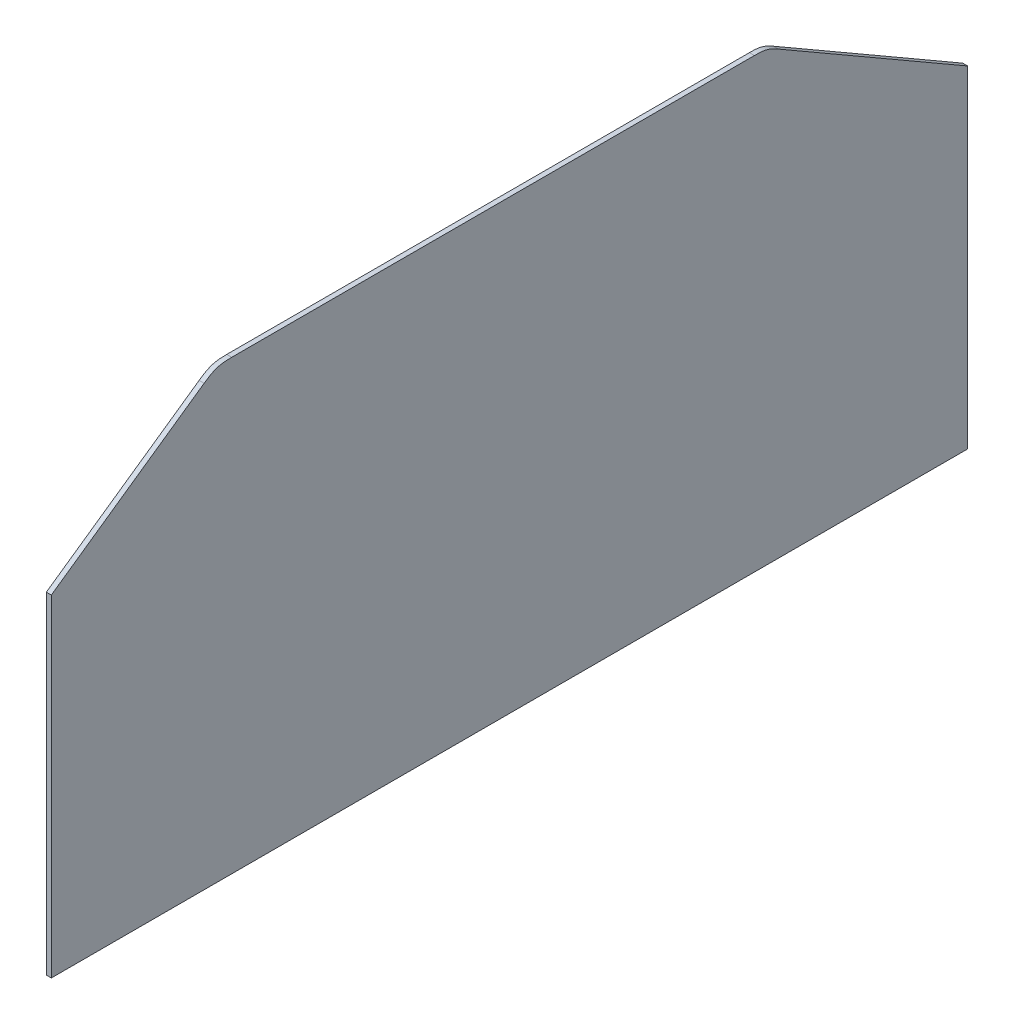
ISO-10303-21;
HEADER;
FILE_DESCRIPTION(('STEP AP214'),'2;1');
FILE_NAME('part.step','',(''),(''),'','','');
FILE_SCHEMA(('AUTOMOTIVE_DESIGN { 1 0 10303 214 1 1 1 1 }'));
ENDSEC;
DATA;
#1=APPLICATION_CONTEXT('core data for automotive mechanical design processes');
#2=APPLICATION_PROTOCOL_DEFINITION('international standard','automotive_design',2000,#1);
#3=PRODUCT_CONTEXT('',#1,'mechanical');
#4=PRODUCT('Part','Part','',(#3));
#5=PRODUCT_RELATED_PRODUCT_CATEGORY('part','',(#4));
#6=PRODUCT_DEFINITION_FORMATION('','',#4);
#7=PRODUCT_DEFINITION_CONTEXT('part definition',#1,'design');
#8=PRODUCT_DEFINITION('design','',#6,#7);
#9=PRODUCT_DEFINITION_SHAPE('','',#8);
#10=(LENGTH_UNIT() NAMED_UNIT(*) SI_UNIT(.MILLI.,.METRE.));
#11=(NAMED_UNIT(*) PLANE_ANGLE_UNIT() SI_UNIT($,.RADIAN.));
#12=(NAMED_UNIT(*) SI_UNIT($,.STERADIAN.) SOLID_ANGLE_UNIT());
#13=UNCERTAINTY_MEASURE_WITH_UNIT(LENGTH_MEASURE(1.E-05),#10,'distance_accuracy_value','');
#14=(GEOMETRIC_REPRESENTATION_CONTEXT(3) GLOBAL_UNCERTAINTY_ASSIGNED_CONTEXT((#13)) GLOBAL_UNIT_ASSIGNED_CONTEXT((#10,
#11,#12)) REPRESENTATION_CONTEXT('',''));
#15=CARTESIAN_POINT('',(0.,0.,0.));
#16=DIRECTION('',(0.,0.,1.));
#17=DIRECTION('',(1.,0.,0.));
#18=AXIS2_PLACEMENT_3D('',#15,#16,#17);
#19=CARTESIAN_POINT('',(-2.588,0.,0.));
#20=DIRECTION('',(0.,0.,1.));
#21=DIRECTION('',(1.,0.,0.));
#22=AXIS2_PLACEMENT_3D('',#19,#20,#21);
#23=PLANE('',#22);
#24=DIRECTION('',(0.,-1.,0.));
#25=VECTOR('',#24,1.);
#26=CARTESIAN_POINT('',(0.,0.,0.));
#27=LINE('',#26,#25);
#28=CARTESIAN_POINT('',(0.,172.,0.));
#29=VERTEX_POINT('',#28);
#30=CARTESIAN_POINT('',(0.,0.,0.));
#31=VERTEX_POINT('',#30);
#32=EDGE_CURVE('E338',#29,#31,#27,.T.);
#33=ORIENTED_EDGE('',*,*,#32,.F.);
#34=DIRECTION('',(1.,0.,0.));
#35=VECTOR('',#34,1.);
#36=CARTESIAN_POINT('',(-2.588,172.,0.));
#37=LINE('',#36,#35);
#38=CARTESIAN_POINT('',(-2.588,172.,0.));
#39=VERTEX_POINT('',#38);
#40=EDGE_CURVE('E141',#39,#29,#37,.T.);
#41=ORIENTED_EDGE('',*,*,#40,.F.);
#42=DIRECTION('',(0.,-1.,0.));
#43=VECTOR('',#42,1.);
#44=CARTESIAN_POINT('',(-2.588,0.,0.));
#45=LINE('',#44,#43);
#46=CARTESIAN_POINT('',(-2.588,0.,0.));
#47=VERTEX_POINT('',#46);
#48=EDGE_CURVE('E135',#39,#47,#45,.T.);
#49=ORIENTED_EDGE('',*,*,#48,.T.);
#50=DIRECTION('',(1.,0.,0.));
#51=VECTOR('',#50,1.);
#52=CARTESIAN_POINT('',(-2.588,0.,0.));
#53=LINE('',#52,#51);
#54=EDGE_CURVE('E119',#47,#31,#53,.T.);
#55=ORIENTED_EDGE('',*,*,#54,.T.);
#56=EDGE_LOOP('',(#33,#41,#49,#55));
#57=FACE_BOUND('',#56,.T.);
#58=ADVANCED_FACE('F43',(#57),#23,.T.);
#59=CARTESIAN_POINT('',(-2.588,172.,0.));
#60=DIRECTION('',(0.,0.819152044288993,0.573576436351044));
#61=DIRECTION('',(0.,-0.573576436351044,0.819152044288993));
#62=AXIS2_PLACEMENT_3D('',#59,#60,#61);
#63=PLANE('',#62);
#64=DIRECTION('',(0.,-0.573576436351044,0.819152044288993));
#65=VECTOR('',#64,1.);
#66=CARTESIAN_POINT('',(0.,172.,0.));
#67=LINE('',#66,#65);
#68=CARTESIAN_POINT('',(0.,227.478801107225,-79.2319392177257));
#69=VERTEX_POINT('',#68);
#70=EDGE_CURVE('E142',#69,#29,#67,.T.);
#71=ORIENTED_EDGE('',*,*,#70,.F.);
#72=CARTESIAN_POINT('',(-2.7174,227.478801107225,-79.2319392177257));
#73=CARTESIAN_POINT('',(-1.76846666666633,227.478801107225,-79.2319392177257));
#74=CARTESIAN_POINT('',(-0.819533333333333,227.478801107225,-79.2319392177257));
#75=CARTESIAN_POINT('',(0.1294,227.478801107225,-79.2319392177257));
#76=B_SPLINE_CURVE_WITH_KNOTS('',3,(#72,#73,#74,#75),.UNSPECIFIED.,.F.,.F.,(4,4),(-0.0001294,
0.0027174),.UNSPECIFIED.);
#77=CARTESIAN_POINT('',(-2.588,227.478801107225,-79.2319392177257));
#78=VERTEX_POINT('',#77);
#79=EDGE_CURVE('E73',#69,#78,#76,.F.);
#80=ORIENTED_EDGE('',*,*,#79,.T.);
#81=DIRECTION('',(0.,-0.573576436351044,0.819152044288993));
#82=VECTOR('',#81,1.);
#83=CARTESIAN_POINT('',(-2.588,172.,0.));
#84=LINE('',#83,#82);
#85=EDGE_CURVE('E130',#78,#39,#84,.T.);
#86=ORIENTED_EDGE('',*,*,#85,.T.);
#87=ORIENTED_EDGE('',*,*,#40,.T.);
#88=EDGE_LOOP('',(#71,#80,#86,#87));
#89=FACE_BOUND('',#88,.T.);
#90=ADVANCED_FACE('F213',(#89),#63,.T.);
#91=CARTESIAN_POINT('',(-2.588,232.,-85.6888804045272));
#92=DIRECTION('',(0.,1.,0.));
#93=DIRECTION('',(0.,0.,1.));
#94=AXIS2_PLACEMENT_3D('',#91,#92,#93);
#95=PLANE('',#94);
#96=DIRECTION('',(0.,0.,1.));
#97=VECTOR('',#96,1.);
#98=CARTESIAN_POINT('',(-2.588,232.,-85.6888804045272));
#99=LINE('',#98,#97);
#100=CARTESIAN_POINT('',(-2.588,232.,-364.60222173509));
#101=VERTEX_POINT('',#100);
#102=CARTESIAN_POINT('',(-2.588,232.,-93.5713501265018));
#103=VERTEX_POINT('',#102);
#104=EDGE_CURVE('E155',#101,#103,#99,.T.);
#105=ORIENTED_EDGE('',*,*,#104,.T.);
#106=CARTESIAN_POINT('',(0.1294,232.,-93.5713501265018));
#107=CARTESIAN_POINT('',(-0.819533333333333,232.,-93.5713501265018));
#108=CARTESIAN_POINT('',(-1.76846666666633,232.,-93.5713501265018));
#109=CARTESIAN_POINT('',(-2.7174,232.,-93.5713501265018));
#110=B_SPLINE_CURVE_WITH_KNOTS('',3,(#106,#107,#108,#109),.UNSPECIFIED.,.F.,.F.,(4,4),
(-0.0001294,0.0027174),.UNSPECIFIED.);
#111=CARTESIAN_POINT('',(0.,232.,-93.5713501265018));
#112=VERTEX_POINT('',#111);
#113=EDGE_CURVE('E291',#103,#112,#110,.F.);
#114=ORIENTED_EDGE('',*,*,#113,.T.);
#115=DIRECTION('',(0.,0.,1.));
#116=VECTOR('',#115,1.);
#117=CARTESIAN_POINT('',(0.,232.,-85.6888804045272));
#118=LINE('',#117,#116);
#119=CARTESIAN_POINT('',(0.,232.,-364.60222173509));
#120=VERTEX_POINT('',#119);
#121=EDGE_CURVE('E144',#120,#112,#118,.T.);
#122=ORIENTED_EDGE('',*,*,#121,.F.);
#123=CARTESIAN_POINT('',(-2.7174,232.,-364.60222173509));
#124=CARTESIAN_POINT('',(-1.76846666666633,232.,-364.60222173509));
#125=CARTESIAN_POINT('',(-0.819533333333333,232.,-364.60222173509));
#126=CARTESIAN_POINT('',(0.1294,232.,-364.60222173509));
#127=B_SPLINE_CURVE_WITH_KNOTS('',3,(#123,#124,#125,#126),.UNSPECIFIED.,.F.,.F.,(4,4),
(-0.0001294,0.0027174),.UNSPECIFIED.);
#128=EDGE_CURVE('E286',#120,#101,#127,.F.);
#129=ORIENTED_EDGE('',*,*,#128,.T.);
#130=EDGE_LOOP('',(#105,#114,#122,#129));
#131=FACE_BOUND('',#130,.T.);
#132=ADVANCED_FACE('F205',(#131),#95,.T.);
#133=CARTESIAN_POINT('',(-2.588,232.,-371.300951545868));
#134=DIRECTION('',(0.,0.866025403784436,-0.500000000000004));
#135=DIRECTION('',(0.,0.500000000000004,0.866025403784436));
#136=AXIS2_PLACEMENT_3D('',#133,#134,#135);
#137=PLANE('',#136);
#138=DIRECTION('',(0.,0.500000000000004,0.866025403784436));
#139=VECTOR('',#138,1.);
#140=CARTESIAN_POINT('',(-2.588,232.,-371.300951545868));
#141=LINE('',#140,#139);
#142=CARTESIAN_POINT('',(-2.588,172.,-475.224));
#143=VERTEX_POINT('',#142);
#144=CARTESIAN_POINT('',(-2.588,228.650635094611,-377.10222173509));
#145=VERTEX_POINT('',#144);
#146=EDGE_CURVE('E148',#143,#145,#141,.T.);
#147=ORIENTED_EDGE('',*,*,#146,.T.);
#148=CARTESIAN_POINT('',(0.1294,228.650635094611,-377.10222173509));
#149=CARTESIAN_POINT('',(-0.819533333333333,228.650635094611,-377.10222173509));
#150=CARTESIAN_POINT('',(-1.76846666666633,228.650635094611,-377.10222173509));
#151=CARTESIAN_POINT('',(-2.7174,228.650635094611,-377.10222173509));
#152=B_SPLINE_CURVE_WITH_KNOTS('',3,(#148,#149,#150,#151),.UNSPECIFIED.,.F.,.F.,(4,4),
(-0.0001294,0.0027174),.UNSPECIFIED.);
#153=CARTESIAN_POINT('',(0.,228.650635094611,-377.10222173509));
#154=VERTEX_POINT('',#153);
#155=EDGE_CURVE('E11',#145,#154,#152,.F.);
#156=ORIENTED_EDGE('',*,*,#155,.T.);
#157=DIRECTION('',(0.,0.500000000000004,0.866025403784436));
#158=VECTOR('',#157,1.);
#159=CARTESIAN_POINT('',(0.,232.,-371.300951545868));
#160=LINE('',#159,#158);
#161=CARTESIAN_POINT('',(0.,172.,-475.224));
#162=VERTEX_POINT('',#161);
#163=EDGE_CURVE('E303',#162,#154,#160,.T.);
#164=ORIENTED_EDGE('',*,*,#163,.F.);
#165=DIRECTION('',(1.,0.,0.));
#166=VECTOR('',#165,1.);
#167=CARTESIAN_POINT('',(-2.588,172.,-475.224));
#168=LINE('',#167,#166);
#169=EDGE_CURVE('E293',#143,#162,#168,.T.);
#170=ORIENTED_EDGE('',*,*,#169,.F.);
#171=EDGE_LOOP('',(#147,#156,#164,#170));
#172=FACE_BOUND('',#171,.T.);
#173=ADVANCED_FACE('F194',(#172),#137,.T.);
#174=CARTESIAN_POINT('',(-2.588,0.,-475.224));
#175=DIRECTION('',(0.,0.,-1.));
#176=DIRECTION('',(-1.,0.,0.));
#177=AXIS2_PLACEMENT_3D('',#174,#175,#176);
#178=PLANE('',#177);
#179=DIRECTION('',(0.,1.,0.));
#180=VECTOR('',#179,1.);
#181=CARTESIAN_POINT('',(0.,0.,-475.224));
#182=LINE('',#181,#180);
#183=CARTESIAN_POINT('',(0.,0.,-475.224));
#184=VERTEX_POINT('',#183);
#185=EDGE_CURVE('E308',#184,#162,#182,.T.);
#186=ORIENTED_EDGE('',*,*,#185,.F.);
#187=DIRECTION('',(1.,0.,0.));
#188=VECTOR('',#187,1.);
#189=CARTESIAN_POINT('',(-2.588,0.,-475.224));
#190=LINE('',#189,#188);
#191=CARTESIAN_POINT('',(-2.588,0.,-475.224));
#192=VERTEX_POINT('',#191);
#193=EDGE_CURVE('E129',#192,#184,#190,.T.);
#194=ORIENTED_EDGE('',*,*,#193,.F.);
#195=DIRECTION('',(0.,1.,0.));
#196=VECTOR('',#195,1.);
#197=CARTESIAN_POINT('',(-2.588,0.,-475.224));
#198=LINE('',#197,#196);
#199=EDGE_CURVE('E137',#192,#143,#198,.T.);
#200=ORIENTED_EDGE('',*,*,#199,.T.);
#201=ORIENTED_EDGE('',*,*,#169,.T.);
#202=EDGE_LOOP('',(#186,#194,#200,#201));
#203=FACE_BOUND('',#202,.T.);
#204=ADVANCED_FACE('F204',(#203),#178,.T.);
#205=CARTESIAN_POINT('',(-2.588,0.,0.));
#206=DIRECTION('',(0.,-1.,0.));
#207=DIRECTION('',(0.,0.,-1.));
#208=AXIS2_PLACEMENT_3D('',#205,#206,#207);
#209=PLANE('',#208);
#210=DIRECTION('',(0.,0.,-1.));
#211=VECTOR('',#210,1.);
#212=CARTESIAN_POINT('',(0.,0.,0.));
#213=LINE('',#212,#211);
#214=EDGE_CURVE('E124',#31,#184,#213,.T.);
#215=ORIENTED_EDGE('',*,*,#214,.F.);
#216=ORIENTED_EDGE('',*,*,#54,.F.);
#217=DIRECTION('',(0.,0.,-1.));
#218=VECTOR('',#217,1.);
#219=CARTESIAN_POINT('',(-2.588,0.,0.));
#220=LINE('',#219,#218);
#221=EDGE_CURVE('E122',#47,#192,#220,.T.);
#222=ORIENTED_EDGE('',*,*,#221,.T.);
#223=ORIENTED_EDGE('',*,*,#193,.T.);
#224=EDGE_LOOP('',(#215,#216,#222,#223));
#225=FACE_BOUND('',#224,.T.);
#226=ADVANCED_FACE('F121',(#225),#209,.T.);
#227=CARTESIAN_POINT('',(-2.588,0.,0.));
#228=DIRECTION('',(-1.,0.,0.));
#229=DIRECTION('',(0.,0.,1.));
#230=AXIS2_PLACEMENT_3D('',#227,#228,#229);
#231=PLANE('',#230);
#232=ORIENTED_EDGE('',*,*,#85,.F.);
#233=CARTESIAN_POINT('',(-2.588,232.,-93.5713501265018));
#234=CARTESIAN_POINT('',(-2.588,232.,-92.1143945913922));
#235=CARTESIAN_POINT('',(-2.588,232.,-90.6574390562825));
#236=CARTESIAN_POINT('',(-2.588,231.792873157131,-87.4103734644801));
#237=CARTESIAN_POINT('',(-2.588,230.842923768706,-84.3975189216432));
#238=CARTESIAN_POINT('',(-2.588,229.150151834725,-81.6188754277721));
#239=CARTESIAN_POINT('',(-2.588,228.314476470975,-80.4254073227489));
#240=CARTESIAN_POINT('',(-2.588,227.478801107225,-79.2319392177257));
#241=B_SPLINE_CURVE_WITH_KNOTS('',5,(#233,#234,#235,#236,#237,#238,#239,#240),.UNSPECIFIED.,.F.,
.F.,(6,2,6),(0.,0.5,1.),.UNSPECIFIED.);
#242=EDGE_CURVE('E57',#78,#103,#241,.F.);
#243=ORIENTED_EDGE('',*,*,#242,.T.);
#244=ORIENTED_EDGE('',*,*,#104,.F.);
#245=CARTESIAN_POINT('',(-2.588,228.650635094611,-377.10222173509));
#246=CARTESIAN_POINT('',(-2.588,229.27211011198,-376.025795429373));
#247=CARTESIAN_POINT('',(-2.588,229.893585129348,-374.949369123656));
#248=CARTESIAN_POINT('',(-2.588,231.148145657227,-372.476974443088));
#249=CARTESIAN_POINT('',(-2.588,231.850283947444,-369.856558670058));
#250=CARTESIAN_POINT('',(-2.588,232.,-367.088121804565));
#251=CARTESIAN_POINT('',(-2.588,232.,-365.845171769828));
#252=CARTESIAN_POINT('',(-2.588,232.,-364.60222173509));
#253=B_SPLINE_CURVE_WITH_KNOTS('',5,(#245,#246,#247,#248,#249,#250,#251,#252),.UNSPECIFIED.,.F.,
.F.,(6,2,6),(0.,0.5,1.),.UNSPECIFIED.);
#254=EDGE_CURVE('E64',#101,#145,#253,.F.);
#255=ORIENTED_EDGE('',*,*,#254,.T.);
#256=ORIENTED_EDGE('',*,*,#146,.F.);
#257=ORIENTED_EDGE('',*,*,#199,.F.);
#258=ORIENTED_EDGE('',*,*,#221,.F.);
#259=ORIENTED_EDGE('',*,*,#48,.F.);
#260=EDGE_LOOP('',(#232,#243,#244,#255,#256,#257,#258,#259));
#261=FACE_BOUND('',#260,.T.);
#262=ADVANCED_FACE('F134',(#261),#231,.T.);
#263=CARTESIAN_POINT('',(0.,0.,0.));
#264=DIRECTION('',(-1.,0.,0.));
#265=DIRECTION('',(0.,0.,1.));
#266=AXIS2_PLACEMENT_3D('',#263,#264,#265);
#267=PLANE('',#266);
#268=ORIENTED_EDGE('',*,*,#121,.T.);
#269=CARTESIAN_POINT('',(0.,227.478801107225,-79.2319392177257));
#270=CARTESIAN_POINT('',(0.,228.314476470975,-80.4254073227489));
#271=CARTESIAN_POINT('',(0.,229.150151834725,-81.6188754277721));
#272=CARTESIAN_POINT('',(0.,230.842923768706,-84.3975189216432));
#273=CARTESIAN_POINT('',(0.,231.792873157131,-87.41037346448));
#274=CARTESIAN_POINT('',(0.,232.,-90.6574390562825));
#275=CARTESIAN_POINT('',(0.,232.,-92.1143945913922));
#276=CARTESIAN_POINT('',(0.,232.,-93.5713501265018));
#277=B_SPLINE_CURVE_WITH_KNOTS('',5,(#269,#270,#271,#272,#273,#274,#275,#276),.UNSPECIFIED.,.F.,
.F.,(6,2,6),(0.,0.5,1.),.UNSPECIFIED.);
#278=EDGE_CURVE('E327',#112,#69,#277,.F.);
#279=ORIENTED_EDGE('',*,*,#278,.T.);
#280=ORIENTED_EDGE('',*,*,#70,.T.);
#281=ORIENTED_EDGE('',*,*,#32,.T.);
#282=ORIENTED_EDGE('',*,*,#214,.T.);
#283=ORIENTED_EDGE('',*,*,#185,.T.);
#284=ORIENTED_EDGE('',*,*,#163,.T.);
#285=CARTESIAN_POINT('',(0.,232.,-364.60222173509));
#286=CARTESIAN_POINT('',(0.,232.,-365.845171769828));
#287=CARTESIAN_POINT('',(0.,232.,-367.088121804565));
#288=CARTESIAN_POINT('',(0.,231.850283947444,-369.856558670058));
#289=CARTESIAN_POINT('',(0.,231.148145657227,-372.476974443088));
#290=CARTESIAN_POINT('',(0.,229.893585129348,-374.949369123656));
#291=CARTESIAN_POINT('',(0.,229.27211011198,-376.025795429373));
#292=CARTESIAN_POINT('',(0.,228.650635094611,-377.10222173509));
#293=B_SPLINE_CURVE_WITH_KNOTS('',5,(#285,#286,#287,#288,#289,#290,#291,#292),.UNSPECIFIED.,.F.,
.F.,(6,2,6),(0.,0.5,1.),.UNSPECIFIED.);
#294=EDGE_CURVE('E260',#154,#120,#293,.F.);
#295=ORIENTED_EDGE('',*,*,#294,.T.);
#296=EDGE_LOOP('',(#268,#279,#280,#281,#282,#283,#284,#295));
#297=FACE_BOUND('',#296,.T.);
#298=ADVANCED_FACE('F173',(#297),#267,.F.);
#299=CARTESIAN_POINT('',(-2.7174,232.,-93.5713501265018));
#300=CARTESIAN_POINT('',(-1.76846666666633,232.,-93.5713501265018));
#301=CARTESIAN_POINT('',(-0.819533333333333,232.,-93.5713501265018));
#302=CARTESIAN_POINT('',(0.1294,232.,-93.5713501265018));
#303=CARTESIAN_POINT('',(-2.7174,232.,-92.1143945913922));
#304=CARTESIAN_POINT('',(-1.76846666666633,232.,-92.1143945913922));
#305=CARTESIAN_POINT('',(-0.819533333333333,232.,-92.1143945913922));
#306=CARTESIAN_POINT('',(0.1294,232.,-92.1143945913922));
#307=CARTESIAN_POINT('',(-2.7174,232.,-90.6574390562825));
#308=CARTESIAN_POINT('',(-1.76846666666633,232.,-90.6574390562825));
#309=CARTESIAN_POINT('',(-0.819533333333333,232.,-90.6574390562825));
#310=CARTESIAN_POINT('',(0.1294,232.,-90.6574390562825));
#311=CARTESIAN_POINT('',(-2.7174,231.792873157131,-87.41037346448));
#312=CARTESIAN_POINT('',(-1.76846666666633,231.792873157131,-87.41037346448));
#313=CARTESIAN_POINT('',(-0.819533333333333,231.792873157131,-87.41037346448));
#314=CARTESIAN_POINT('',(0.1294,231.792873157131,-87.41037346448));
#315=CARTESIAN_POINT('',(-2.7174,230.842923768706,-84.3975189216432));
#316=CARTESIAN_POINT('',(-1.76846666666633,230.842923768706,-84.3975189216432));
#317=CARTESIAN_POINT('',(-0.819533333333333,230.842923768706,-84.3975189216432));
#318=CARTESIAN_POINT('',(0.1294,230.842923768706,-84.3975189216432));
#319=CARTESIAN_POINT('',(-2.7174,229.150151834725,-81.6188754277721));
#320=CARTESIAN_POINT('',(-1.76846666666633,229.150151834725,-81.6188754277721));
#321=CARTESIAN_POINT('',(-0.819533333333333,229.150151834725,-81.6188754277721));
#322=CARTESIAN_POINT('',(0.1294,229.150151834725,-81.6188754277721));
#323=CARTESIAN_POINT('',(-2.7174,228.314476470975,-80.4254073227489));
#324=CARTESIAN_POINT('',(-1.76846666666633,228.314476470975,-80.4254073227489));
#325=CARTESIAN_POINT('',(-0.819533333333333,228.314476470975,-80.4254073227489));
#326=CARTESIAN_POINT('',(0.1294,228.314476470975,-80.4254073227489));
#327=CARTESIAN_POINT('',(-2.7174,227.478801107225,-79.2319392177257));
#328=CARTESIAN_POINT('',(-1.76846666666633,227.478801107225,-79.2319392177257));
#329=CARTESIAN_POINT('',(-0.819533333333333,227.478801107225,-79.2319392177257));
#330=CARTESIAN_POINT('',(0.1294,227.478801107225,-79.2319392177257));
#331=B_SPLINE_SURFACE_WITH_KNOTS('',5,3,((#299,#300,#301,#302),(#303,#304,#305,#306),(#307,#308,
#309,#310),(#311,#312,#313,#314),(#315,#316,#317,#318),(#319,#320,#321,#322),(#323,#324,#325,
#326),(#327,#328,#329,#330)),.UNSPECIFIED.,.F.,.F.,.F.,(6,2,6),(4,4),(0.,0.5,1.),(-0.0001294,
0.0027174),.UNSPECIFIED.);
#332=ORIENTED_EDGE('',*,*,#242,.F.);
#333=ORIENTED_EDGE('',*,*,#79,.F.);
#334=ORIENTED_EDGE('',*,*,#278,.F.);
#335=ORIENTED_EDGE('',*,*,#113,.F.);
#336=EDGE_LOOP('',(#332,#333,#334,#335));
#337=FACE_BOUND('',#336,.T.);
#338=ADVANCED_FACE('F215',(#337),#331,.T.);
#339=CARTESIAN_POINT('',(-2.7174,228.650635094611,-377.10222173509));
#340=CARTESIAN_POINT('',(-1.76846666666633,228.650635094611,-377.10222173509));
#341=CARTESIAN_POINT('',(-0.819533333333333,228.650635094611,-377.10222173509));
#342=CARTESIAN_POINT('',(0.1294,228.650635094611,-377.10222173509));
#343=CARTESIAN_POINT('',(-2.7174,229.27211011198,-376.025795429373));
#344=CARTESIAN_POINT('',(-1.76846666666633,229.27211011198,-376.025795429373));
#345=CARTESIAN_POINT('',(-0.819533333333333,229.27211011198,-376.025795429373));
#346=CARTESIAN_POINT('',(0.1294,229.27211011198,-376.025795429373));
#347=CARTESIAN_POINT('',(-2.7174,229.893585129348,-374.949369123656));
#348=CARTESIAN_POINT('',(-1.76846666666633,229.893585129348,-374.949369123656));
#349=CARTESIAN_POINT('',(-0.819533333333333,229.893585129348,-374.949369123656));
#350=CARTESIAN_POINT('',(0.1294,229.893585129348,-374.949369123656));
#351=CARTESIAN_POINT('',(-2.7174,231.148145657227,-372.476974443088));
#352=CARTESIAN_POINT('',(-1.76846666666633,231.148145657227,-372.476974443088));
#353=CARTESIAN_POINT('',(-0.819533333333333,231.148145657227,-372.476974443088));
#354=CARTESIAN_POINT('',(0.1294,231.148145657227,-372.476974443088));
#355=CARTESIAN_POINT('',(-2.7174,231.850283947444,-369.856558670058));
#356=CARTESIAN_POINT('',(-1.76846666666633,231.850283947444,-369.856558670058));
#357=CARTESIAN_POINT('',(-0.819533333333333,231.850283947444,-369.856558670058));
#358=CARTESIAN_POINT('',(0.1294,231.850283947444,-369.856558670058));
#359=CARTESIAN_POINT('',(-2.7174,232.,-367.088121804565));
#360=CARTESIAN_POINT('',(-1.76846666666633,232.,-367.088121804565));
#361=CARTESIAN_POINT('',(-0.819533333333333,232.,-367.088121804565));
#362=CARTESIAN_POINT('',(0.1294,232.,-367.088121804565));
#363=CARTESIAN_POINT('',(-2.7174,232.,-365.845171769828));
#364=CARTESIAN_POINT('',(-1.76846666666633,232.,-365.845171769828));
#365=CARTESIAN_POINT('',(-0.819533333333333,232.,-365.845171769828));
#366=CARTESIAN_POINT('',(0.1294,232.,-365.845171769828));
#367=CARTESIAN_POINT('',(-2.7174,232.,-364.60222173509));
#368=CARTESIAN_POINT('',(-1.76846666666633,232.,-364.60222173509));
#369=CARTESIAN_POINT('',(-0.819533333333333,232.,-364.60222173509));
#370=CARTESIAN_POINT('',(0.1294,232.,-364.60222173509));
#371=B_SPLINE_SURFACE_WITH_KNOTS('',5,3,((#339,#340,#341,#342),(#343,#344,#345,#346),(#347,#348,
#349,#350),(#351,#352,#353,#354),(#355,#356,#357,#358),(#359,#360,#361,#362),(#363,#364,#365,
#366),(#367,#368,#369,#370)),.UNSPECIFIED.,.F.,.F.,.F.,(6,2,6),(4,4),(0.,0.5,1.),(-0.0001294,
0.0027174),.UNSPECIFIED.);
#372=ORIENTED_EDGE('',*,*,#254,.F.);
#373=ORIENTED_EDGE('',*,*,#128,.F.);
#374=ORIENTED_EDGE('',*,*,#294,.F.);
#375=ORIENTED_EDGE('',*,*,#155,.F.);
#376=EDGE_LOOP('',(#372,#373,#374,#375));
#377=FACE_BOUND('',#376,.T.);
#378=ADVANCED_FACE('F46',(#377),#371,.T.);
#379=CLOSED_SHELL('',(#58,#90,#132,#173,#204,#226,#262,#298,#338,#378));
#380=MANIFOLD_SOLID_BREP('B2',#379);
#381=ADVANCED_BREP_SHAPE_REPRESENTATION('',(#18,#380),#14);
#382=SHAPE_DEFINITION_REPRESENTATION(#9,#381);
ENDSEC;
END-ISO-10303-21;
